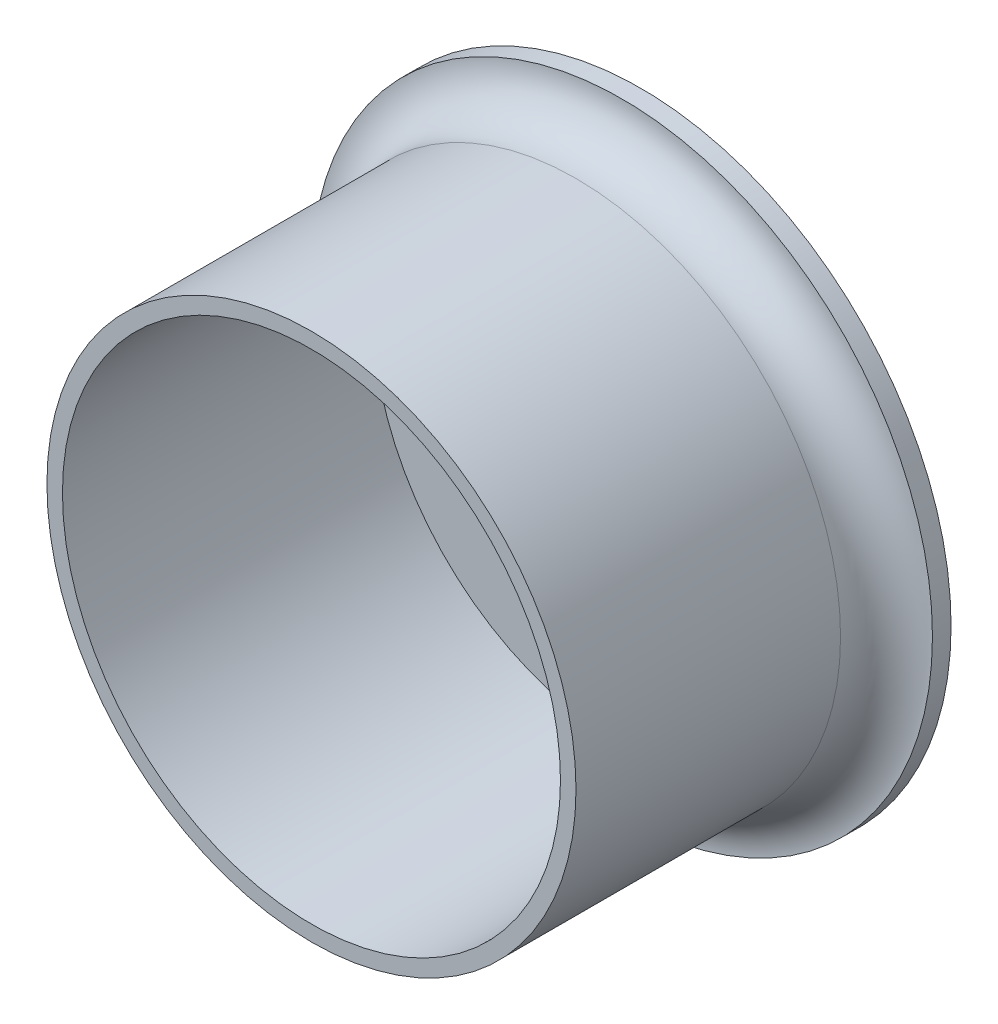
ISO-10303-21;
HEADER;
FILE_DESCRIPTION(('STEP AP214'),'2;1');
FILE_NAME('part.step','',(''),(''),'','','');
FILE_SCHEMA(('AUTOMOTIVE_DESIGN { 1 0 10303 214 1 1 1 1 }'));
ENDSEC;
DATA;
#1=APPLICATION_CONTEXT('core data for automotive mechanical design processes');
#2=APPLICATION_PROTOCOL_DEFINITION('international standard','automotive_design',2000,#1);
#3=PRODUCT_CONTEXT('',#1,'mechanical');
#4=PRODUCT('Part','Part','',(#3));
#5=PRODUCT_RELATED_PRODUCT_CATEGORY('part','',(#4));
#6=PRODUCT_DEFINITION_FORMATION('','',#4);
#7=PRODUCT_DEFINITION_CONTEXT('part definition',#1,'design');
#8=PRODUCT_DEFINITION('design','',#6,#7);
#9=PRODUCT_DEFINITION_SHAPE('','',#8);
#10=(LENGTH_UNIT() NAMED_UNIT(*) SI_UNIT(.MILLI.,.METRE.));
#11=(NAMED_UNIT(*) PLANE_ANGLE_UNIT() SI_UNIT($,.RADIAN.));
#12=(NAMED_UNIT(*) SI_UNIT($,.STERADIAN.) SOLID_ANGLE_UNIT());
#13=UNCERTAINTY_MEASURE_WITH_UNIT(LENGTH_MEASURE(1.E-05),#10,'distance_accuracy_value','');
#14=(GEOMETRIC_REPRESENTATION_CONTEXT(3) GLOBAL_UNCERTAINTY_ASSIGNED_CONTEXT((#13)) GLOBAL_UNIT_ASSIGNED_CONTEXT((#10,
#11,#12)) REPRESENTATION_CONTEXT('',''));
#15=CARTESIAN_POINT('',(0.,0.,0.));
#16=DIRECTION('',(0.,0.,1.));
#17=DIRECTION('',(1.,0.,0.));
#18=AXIS2_PLACEMENT_3D('',#15,#16,#17);
#19=CARTESIAN_POINT('',(0.,0.,-50.));
#20=DIRECTION('',(0.,0.,1.));
#21=DIRECTION('',(1.,0.,0.));
#22=AXIS2_PLACEMENT_3D('',#19,#20,#21);
#23=CYLINDRICAL_SURFACE('',#22,40.1);
#24=CARTESIAN_POINT('',(0.,0.,-50.));
#25=DIRECTION('',(0.,0.,1.));
#26=DIRECTION('',(1.,0.,0.));
#27=AXIS2_PLACEMENT_3D('',#24,#25,#26);
#28=CIRCLE('',#27,40.1);
#29=CARTESIAN_POINT('',(40.1,0.,-50.));
#30=VERTEX_POINT('',#29);
#31=EDGE_CURVE('E80',#30,#30,#28,.T.);
#32=ORIENTED_EDGE('',*,*,#31,.F.);
#33=EDGE_LOOP('',(#32));
#34=FACE_BOUND('',#33,.T.);
#35=CARTESIAN_POINT('',(0.,0.,0.));
#36=DIRECTION('',(0.,0.,1.));
#37=DIRECTION('',(1.,0.,0.));
#38=AXIS2_PLACEMENT_3D('',#35,#36,#37);
#39=CIRCLE('',#38,40.1);
#40=CARTESIAN_POINT('',(40.1,0.,0.));
#41=VERTEX_POINT('',#40);
#42=EDGE_CURVE('E89',#41,#41,#39,.T.);
#43=ORIENTED_EDGE('',*,*,#42,.T.);
#44=EDGE_LOOP('',(#43));
#45=FACE_BOUND('',#44,.T.);
#46=ADVANCED_FACE('F73',(#34,#45),#23,.F.);
#47=CARTESIAN_POINT('',(0.,0.,-50.));
#48=DIRECTION('',(0.,0.,1.));
#49=DIRECTION('',(1.,0.,0.));
#50=AXIS2_PLACEMENT_3D('',#47,#48,#49);
#51=CYLINDRICAL_SURFACE('',#50,42.6);
#52=CARTESIAN_POINT('',(0.,0.,-42.6));
#53=DIRECTION('',(0.,0.,-1.));
#54=DIRECTION('',(-1.,0.,0.));
#55=AXIS2_PLACEMENT_3D('',#52,#53,#54);
#56=CIRCLE('',#55,42.6);
#57=CARTESIAN_POINT('',(-42.6,0.,-42.6));
#58=VERTEX_POINT('',#57);
#59=EDGE_CURVE('E11',#58,#58,#56,.F.);
#60=ORIENTED_EDGE('',*,*,#59,.T.);
#61=EDGE_LOOP('',(#60));
#62=FACE_BOUND('',#61,.T.);
#63=CARTESIAN_POINT('',(0.,0.,0.));
#64=DIRECTION('',(0.,0.,1.));
#65=DIRECTION('',(1.,0.,0.));
#66=AXIS2_PLACEMENT_3D('',#63,#64,#65);
#67=CIRCLE('',#66,42.6);
#68=CARTESIAN_POINT('',(42.6,0.,0.));
#69=VERTEX_POINT('',#68);
#70=EDGE_CURVE('E84',#69,#69,#67,.T.);
#71=ORIENTED_EDGE('',*,*,#70,.F.);
#72=EDGE_LOOP('',(#71));
#73=FACE_BOUND('',#72,.T.);
#74=ADVANCED_FACE('F128',(#62,#73),#51,.T.);
#75=CARTESIAN_POINT('',(0.,0.,0.));
#76=DIRECTION('',(0.,0.,1.));
#77=DIRECTION('',(1.,0.,0.));
#78=AXIS2_PLACEMENT_3D('',#75,#76,#77);
#79=PLANE('',#78);
#80=ORIENTED_EDGE('',*,*,#42,.F.);
#81=EDGE_LOOP('',(#80));
#82=FACE_BOUND('',#81,.T.);
#83=ORIENTED_EDGE('',*,*,#70,.T.);
#84=EDGE_LOOP('',(#83));
#85=FACE_BOUND('',#84,.T.);
#86=ADVANCED_FACE('F135',(#82,#85),#79,.T.);
#87=CARTESIAN_POINT('',(0.,0.,-53.));
#88=DIRECTION('',(0.,0.,-1.));
#89=DIRECTION('',(-1.,0.,0.));
#90=AXIS2_PLACEMENT_3D('',#87,#88,#89);
#91=PLANE('',#90);
#92=CARTESIAN_POINT('',(0.,0.,-53.));
#93=DIRECTION('',(0.,0.,-1.));
#94=DIRECTION('',(-1.,0.,0.));
#95=AXIS2_PLACEMENT_3D('',#92,#93,#94);
#96=CIRCLE('',#95,45.);
#97=CARTESIAN_POINT('',(-45.,0.,-53.));
#98=VERTEX_POINT('',#97);
#99=EDGE_CURVE('E366',#98,#98,#96,.T.);
#100=ORIENTED_EDGE('',*,*,#99,.F.);
#101=EDGE_LOOP('',(#100));
#102=FACE_BOUND('',#101,.T.);
#103=CARTESIAN_POINT('',(0.,0.,-53.));
#104=DIRECTION('',(0.,0.,-1.));
#105=DIRECTION('',(-1.,0.,0.));
#106=AXIS2_PLACEMENT_3D('',#103,#104,#105);
#107=CIRCLE('',#106,50.);
#108=CARTESIAN_POINT('',(-50.,0.,-53.));
#109=VERTEX_POINT('',#108);
#110=EDGE_CURVE('E96',#109,#109,#107,.T.);
#111=ORIENTED_EDGE('',*,*,#110,.T.);
#112=EDGE_LOOP('',(#111));
#113=FACE_BOUND('',#112,.T.);
#114=ADVANCED_FACE('F219',(#102,#113),#91,.T.);
#115=CARTESIAN_POINT('',(0.,0.,-53.));
#116=DIRECTION('',(0.,0.,1.));
#117=DIRECTION('',(1.,0.,0.));
#118=AXIS2_PLACEMENT_3D('',#115,#116,#117);
#119=CYLINDRICAL_SURFACE('',#118,50.);
#120=ORIENTED_EDGE('',*,*,#110,.F.);
#121=EDGE_LOOP('',(#120));
#122=FACE_BOUND('',#121,.T.);
#123=CARTESIAN_POINT('',(0.,0.,-50.));
#124=DIRECTION('',(0.,0.,-1.));
#125=DIRECTION('',(-1.,0.,0.));
#126=AXIS2_PLACEMENT_3D('',#123,#124,#125);
#127=CIRCLE('',#126,50.);
#128=CARTESIAN_POINT('',(-50.,0.,-50.));
#129=VERTEX_POINT('',#128);
#130=EDGE_CURVE('E93',#129,#129,#127,.T.);
#131=ORIENTED_EDGE('',*,*,#130,.T.);
#132=EDGE_LOOP('',(#131));
#133=FACE_BOUND('',#132,.T.);
#134=ADVANCED_FACE('F189',(#122,#133),#119,.T.);
#135=CARTESIAN_POINT('',(0.,0.,-50.));
#136=DIRECTION('',(0.,0.,-1.));
#137=DIRECTION('',(-1.,0.,0.));
#138=AXIS2_PLACEMENT_3D('',#135,#136,#137);
#139=PLANE('',#138);
#140=ORIENTED_EDGE('',*,*,#31,.T.);
#141=EDGE_LOOP('',(#140));
#142=FACE_BOUND('',#141,.T.);
#143=ADVANCED_FACE('F235',(#142),#139,.F.);
#144=CARTESIAN_POINT('',(0.,0.,-53.));
#145=DIRECTION('',(0.,0.,-1.));
#146=DIRECTION('',(-1.,0.,0.));
#147=AXIS2_PLACEMENT_3D('',#144,#145,#146);
#148=CIRCLE('',#147,35.);
#149=CARTESIAN_POINT('',(-35.,0.,-53.));
#150=VERTEX_POINT('',#149);
#151=EDGE_CURVE('E182',#150,#150,#148,.T.);
#152=ORIENTED_EDGE('',*,*,#151,.F.);
#153=EDGE_LOOP('',(#152));
#154=FACE_BOUND('',#153,.T.);
#155=CARTESIAN_POINT('',(0.,0.,-53.));
#156=DIRECTION('',(0.,0.,-1.));
#157=DIRECTION('',(-1.,0.,0.));
#158=AXIS2_PLACEMENT_3D('',#155,#156,#157);
#159=CIRCLE('',#158,43.);
#160=CARTESIAN_POINT('',(-43.,0.,-53.));
#161=VERTEX_POINT('',#160);
#162=EDGE_CURVE('E101',#161,#161,#159,.T.);
#163=ORIENTED_EDGE('',*,*,#162,.T.);
#164=EDGE_LOOP('',(#163));
#165=FACE_BOUND('',#164,.T.);
#166=ADVANCED_FACE('F242',(#154,#165),#91,.T.);
#167=CARTESIAN_POINT('',(0.,0.,-53.));
#168=DIRECTION('',(0.,0.,-1.));
#169=DIRECTION('',(-1.,0.,0.));
#170=AXIS2_PLACEMENT_3D('',#167,#168,#169);
#171=CIRCLE('',#170,25.);
#172=CARTESIAN_POINT('',(-25.,0.,-53.));
#173=VERTEX_POINT('',#172);
#174=EDGE_CURVE('E164',#173,#173,#171,.T.);
#175=ORIENTED_EDGE('',*,*,#174,.F.);
#176=EDGE_LOOP('',(#175));
#177=FACE_BOUND('',#176,.T.);
#178=CARTESIAN_POINT('',(0.,0.,-53.));
#179=DIRECTION('',(0.,0.,-1.));
#180=DIRECTION('',(-1.,0.,0.));
#181=AXIS2_PLACEMENT_3D('',#178,#179,#180);
#182=CIRCLE('',#181,33.);
#183=CARTESIAN_POINT('',(-33.,0.,-53.));
#184=VERTEX_POINT('',#183);
#185=EDGE_CURVE('E173',#184,#184,#182,.T.);
#186=ORIENTED_EDGE('',*,*,#185,.T.);
#187=EDGE_LOOP('',(#186));
#188=FACE_BOUND('',#187,.T.);
#189=ADVANCED_FACE('F228',(#177,#188),#91,.T.);
#190=CARTESIAN_POINT('',(0.,0.,-53.));
#191=DIRECTION('',(0.,0.,-1.));
#192=DIRECTION('',(-1.,0.,0.));
#193=AXIS2_PLACEMENT_3D('',#190,#191,#192);
#194=CIRCLE('',#193,15.);
#195=CARTESIAN_POINT('',(-15.,0.,-53.));
#196=VERTEX_POINT('',#195);
#197=EDGE_CURVE('E171',#196,#196,#194,.T.);
#198=ORIENTED_EDGE('',*,*,#197,.F.);
#199=EDGE_LOOP('',(#198));
#200=FACE_BOUND('',#199,.T.);
#201=CARTESIAN_POINT('',(0.,0.,-53.));
#202=DIRECTION('',(0.,0.,-1.));
#203=DIRECTION('',(-1.,0.,0.));
#204=AXIS2_PLACEMENT_3D('',#201,#202,#203);
#205=CIRCLE('',#204,23.);
#206=CARTESIAN_POINT('',(-23.,0.,-53.));
#207=VERTEX_POINT('',#206);
#208=EDGE_CURVE('E169',#207,#207,#205,.T.);
#209=ORIENTED_EDGE('',*,*,#208,.T.);
#210=EDGE_LOOP('',(#209));
#211=FACE_BOUND('',#210,.T.);
#212=ADVANCED_FACE('F249',(#200,#211),#91,.T.);
#213=CARTESIAN_POINT('',(0.,0.,-53.));
#214=DIRECTION('',(0.,0.,-1.));
#215=DIRECTION('',(-1.,0.,0.));
#216=AXIS2_PLACEMENT_3D('',#213,#214,#215);
#217=CIRCLE('',#216,13.);
#218=CARTESIAN_POINT('',(-13.,0.,-53.));
#219=VERTEX_POINT('',#218);
#220=EDGE_CURVE('E176',#219,#219,#217,.T.);
#221=ORIENTED_EDGE('',*,*,#220,.T.);
#222=EDGE_LOOP('',(#221));
#223=FACE_BOUND('',#222,.T.);
#224=ADVANCED_FACE('F148',(#223),#91,.T.);
#225=CARTESIAN_POINT('',(0.,0.,-53.));
#226=DIRECTION('',(0.,0.,-1.));
#227=DIRECTION('',(-1.,0.,0.));
#228=AXIS2_PLACEMENT_3D('',#225,#226,#227);
#229=TOROIDAL_SURFACE('',#228,44.,1.);
#230=ORIENTED_EDGE('',*,*,#162,.F.);
#231=EDGE_LOOP('',(#230));
#232=FACE_BOUND('',#231,.T.);
#233=CARTESIAN_POINT('',(0.,0.,-52.));
#234=DIRECTION('',(0.,0.,-1.));
#235=DIRECTION('',(-1.,0.,0.));
#236=AXIS2_PLACEMENT_3D('',#233,#234,#235);
#237=CIRCLE('',#236,44.);
#238=CARTESIAN_POINT('',(-44.,0.,-52.));
#239=VERTEX_POINT('',#238);
#240=EDGE_CURVE('E98',#239,#239,#237,.F.);
#241=ORIENTED_EDGE('',*,*,#240,.F.);
#242=EDGE_LOOP('',(#241));
#243=FACE_BOUND('',#242,.T.);
#244=ADVANCED_FACE('F144',(#232,#243),#229,.F.);
#245=CARTESIAN_POINT('',(0.,0.,-53.));
#246=DIRECTION('',(0.,0.,-1.));
#247=DIRECTION('',(-1.,0.,0.));
#248=AXIS2_PLACEMENT_3D('',#245,#246,#247);
#249=TOROIDAL_SURFACE('',#248,44.,1.);
#250=ORIENTED_EDGE('',*,*,#99,.T.);
#251=EDGE_LOOP('',(#250));
#252=FACE_BOUND('',#251,.T.);
#253=ORIENTED_EDGE('',*,*,#240,.T.);
#254=EDGE_LOOP('',(#253));
#255=FACE_BOUND('',#254,.T.);
#256=ADVANCED_FACE('F140',(#252,#255),#249,.F.);
#257=CARTESIAN_POINT('',(0.,0.,-53.));
#258=DIRECTION('',(0.,0.,-1.));
#259=DIRECTION('',(-1.,0.,0.));
#260=AXIS2_PLACEMENT_3D('',#257,#258,#259);
#261=TOROIDAL_SURFACE('',#260,14.,1.);
#262=ORIENTED_EDGE('',*,*,#220,.F.);
#263=EDGE_LOOP('',(#262));
#264=FACE_BOUND('',#263,.T.);
#265=CARTESIAN_POINT('',(0.,0.,-52.));
#266=DIRECTION('',(0.,0.,-1.));
#267=DIRECTION('',(-1.,0.,0.));
#268=AXIS2_PLACEMENT_3D('',#265,#266,#267);
#269=CIRCLE('',#268,14.);
#270=CARTESIAN_POINT('',(-14.,0.,-52.));
#271=VERTEX_POINT('',#270);
#272=EDGE_CURVE('E102',#271,#271,#269,.F.);
#273=ORIENTED_EDGE('',*,*,#272,.F.);
#274=EDGE_LOOP('',(#273));
#275=FACE_BOUND('',#274,.T.);
#276=ADVANCED_FACE('F143',(#264,#275),#261,.F.);
#277=CARTESIAN_POINT('',(0.,0.,-53.));
#278=DIRECTION('',(0.,0.,-1.));
#279=DIRECTION('',(-1.,0.,0.));
#280=AXIS2_PLACEMENT_3D('',#277,#278,#279);
#281=TOROIDAL_SURFACE('',#280,14.,1.);
#282=ORIENTED_EDGE('',*,*,#197,.T.);
#283=EDGE_LOOP('',(#282));
#284=FACE_BOUND('',#283,.T.);
#285=ORIENTED_EDGE('',*,*,#272,.T.);
#286=EDGE_LOOP('',(#285));
#287=FACE_BOUND('',#286,.T.);
#288=ADVANCED_FACE('F150',(#284,#287),#281,.F.);
#289=CARTESIAN_POINT('',(0.,0.,-53.));
#290=DIRECTION('',(0.,0.,-1.));
#291=DIRECTION('',(-1.,0.,0.));
#292=AXIS2_PLACEMENT_3D('',#289,#290,#291);
#293=TOROIDAL_SURFACE('',#292,24.,1.);
#294=ORIENTED_EDGE('',*,*,#174,.T.);
#295=EDGE_LOOP('',(#294));
#296=FACE_BOUND('',#295,.T.);
#297=CARTESIAN_POINT('',(0.,0.,-52.));
#298=DIRECTION('',(0.,0.,-1.));
#299=DIRECTION('',(-1.,0.,0.));
#300=AXIS2_PLACEMENT_3D('',#297,#298,#299);
#301=CIRCLE('',#300,24.);
#302=CARTESIAN_POINT('',(-24.,0.,-52.));
#303=VERTEX_POINT('',#302);
#304=EDGE_CURVE('E105',#303,#303,#301,.T.);
#305=ORIENTED_EDGE('',*,*,#304,.F.);
#306=EDGE_LOOP('',(#305));
#307=FACE_BOUND('',#306,.T.);
#308=ADVANCED_FACE('F123',(#296,#307),#293,.F.);
#309=CARTESIAN_POINT('',(0.,0.,-53.));
#310=DIRECTION('',(0.,0.,-1.));
#311=DIRECTION('',(-1.,0.,0.));
#312=AXIS2_PLACEMENT_3D('',#309,#310,#311);
#313=TOROIDAL_SURFACE('',#312,24.,1.);
#314=ORIENTED_EDGE('',*,*,#304,.T.);
#315=EDGE_LOOP('',(#314));
#316=FACE_BOUND('',#315,.T.);
#317=ORIENTED_EDGE('',*,*,#208,.F.);
#318=EDGE_LOOP('',(#317));
#319=FACE_BOUND('',#318,.T.);
#320=ADVANCED_FACE('F116',(#316,#319),#313,.F.);
#321=CARTESIAN_POINT('',(0.,0.,-53.));
#322=DIRECTION('',(0.,0.,-1.));
#323=DIRECTION('',(-1.,0.,0.));
#324=AXIS2_PLACEMENT_3D('',#321,#322,#323);
#325=TOROIDAL_SURFACE('',#324,34.,1.);
#326=ORIENTED_EDGE('',*,*,#151,.T.);
#327=EDGE_LOOP('',(#326));
#328=FACE_BOUND('',#327,.T.);
#329=CARTESIAN_POINT('',(0.,0.,-52.));
#330=DIRECTION('',(0.,0.,-1.));
#331=DIRECTION('',(-1.,0.,0.));
#332=AXIS2_PLACEMENT_3D('',#329,#330,#331);
#333=CIRCLE('',#332,34.);
#334=CARTESIAN_POINT('',(-34.,0.,-52.));
#335=VERTEX_POINT('',#334);
#336=EDGE_CURVE('E107',#335,#335,#333,.T.);
#337=ORIENTED_EDGE('',*,*,#336,.F.);
#338=EDGE_LOOP('',(#337));
#339=FACE_BOUND('',#338,.T.);
#340=ADVANCED_FACE('F114',(#328,#339),#325,.F.);
#341=CARTESIAN_POINT('',(0.,0.,-53.));
#342=DIRECTION('',(0.,0.,-1.));
#343=DIRECTION('',(-1.,0.,0.));
#344=AXIS2_PLACEMENT_3D('',#341,#342,#343);
#345=TOROIDAL_SURFACE('',#344,34.,1.);
#346=ORIENTED_EDGE('',*,*,#336,.T.);
#347=EDGE_LOOP('',(#346));
#348=FACE_BOUND('',#347,.T.);
#349=ORIENTED_EDGE('',*,*,#185,.F.);
#350=EDGE_LOOP('',(#349));
#351=FACE_BOUND('',#350,.T.);
#352=ADVANCED_FACE('F111',(#348,#351),#345,.F.);
#353=CARTESIAN_POINT('',(0.,0.,-42.6));
#354=DIRECTION('',(0.,0.,-1.));
#355=DIRECTION('',(-1.,0.,0.));
#356=AXIS2_PLACEMENT_3D('',#353,#354,#355);
#357=TOROIDAL_SURFACE('',#356,50.,7.4);
#358=ORIENTED_EDGE('',*,*,#130,.F.);
#359=EDGE_LOOP('',(#358));
#360=FACE_BOUND('',#359,.T.);
#361=ORIENTED_EDGE('',*,*,#59,.F.);
#362=EDGE_LOOP('',(#361));
#363=FACE_BOUND('',#362,.T.);
#364=ADVANCED_FACE('F75',(#360,#363),#357,.F.);
#365=CLOSED_SHELL('',(#46,#74,#86,#114,#134,#143,#166,#189,#212,#224,#244,#256,#276,#288,#308,
#320,#340,#352,#364));
#366=MANIFOLD_SOLID_BREP('B2',#365);
#367=ADVANCED_BREP_SHAPE_REPRESENTATION('',(#18,#366),#14);
#368=SHAPE_DEFINITION_REPRESENTATION(#9,#367);
ENDSEC;
END-ISO-10303-21;
